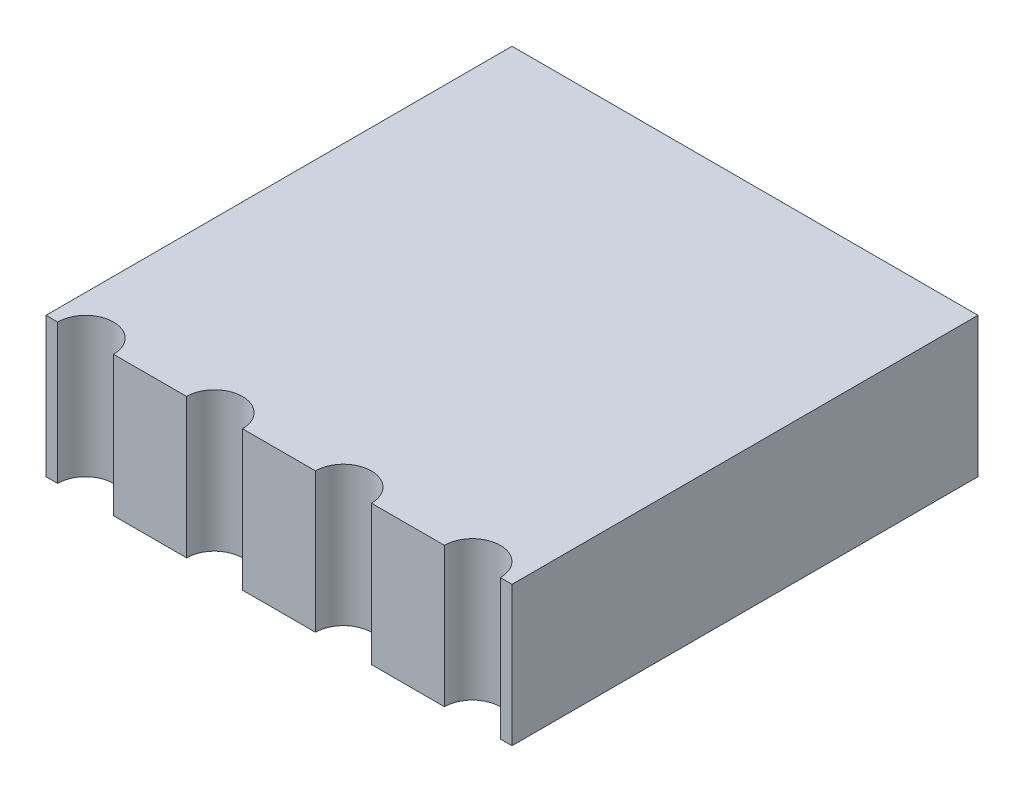
ISO-10303-21;
HEADER;
FILE_DESCRIPTION(('STEP AP214'),'2;1');
FILE_NAME('part.step','',(''),(''),'','','');
FILE_SCHEMA(('AUTOMOTIVE_DESIGN { 1 0 10303 214 1 1 1 1 }'));
ENDSEC;
DATA;
#1=APPLICATION_CONTEXT('core data for automotive mechanical design processes');
#2=APPLICATION_PROTOCOL_DEFINITION('international standard','automotive_design',2000,#1);
#3=PRODUCT_CONTEXT('',#1,'mechanical');
#4=PRODUCT('Part','Part','',(#3));
#5=PRODUCT_RELATED_PRODUCT_CATEGORY('part','',(#4));
#6=PRODUCT_DEFINITION_FORMATION('','',#4);
#7=PRODUCT_DEFINITION_CONTEXT('part definition',#1,'design');
#8=PRODUCT_DEFINITION('design','',#6,#7);
#9=PRODUCT_DEFINITION_SHAPE('','',#8);
#10=(LENGTH_UNIT() NAMED_UNIT(*) SI_UNIT(.MILLI.,.METRE.));
#11=(NAMED_UNIT(*) PLANE_ANGLE_UNIT() SI_UNIT($,.RADIAN.));
#12=(NAMED_UNIT(*) SI_UNIT($,.STERADIAN.) SOLID_ANGLE_UNIT());
#13=UNCERTAINTY_MEASURE_WITH_UNIT(LENGTH_MEASURE(1.E-05),#10,'distance_accuracy_value','');
#14=(GEOMETRIC_REPRESENTATION_CONTEXT(3) GLOBAL_UNCERTAINTY_ASSIGNED_CONTEXT((#13)) GLOBAL_UNIT_ASSIGNED_CONTEXT((#10,
#11,#12)) REPRESENTATION_CONTEXT('',''));
#15=CARTESIAN_POINT('',(0.,0.,0.));
#16=DIRECTION('',(0.,0.,1.));
#17=DIRECTION('',(1.,0.,0.));
#18=AXIS2_PLACEMENT_3D('',#15,#16,#17);
#19=CARTESIAN_POINT('',(-5.,1.5,5.));
#20=DIRECTION('',(0.,0.,-1.));
#21=DIRECTION('',(-1.,0.,0.));
#22=AXIS2_PLACEMENT_3D('',#19,#20,#21);
#23=PLANE('',#22);
#24=DIRECTION('',(1.,0.,0.));
#25=VECTOR('',#24,1.);
#26=CARTESIAN_POINT('',(-5.,-1.5,5.));
#27=LINE('',#26,#25);
#28=CARTESIAN_POINT('',(-3.55,-1.5,5.));
#29=VERTEX_POINT('',#28);
#30=CARTESIAN_POINT('',(-1.98333333333333,-1.5,5.));
#31=VERTEX_POINT('',#30);
#32=EDGE_CURVE('E151',#29,#31,#27,.T.);
#33=ORIENTED_EDGE('',*,*,#32,.T.);
#34=DIRECTION('',(0.,1.,0.));
#35=VECTOR('',#34,1.);
#36=CARTESIAN_POINT('',(-1.98333333333333,-1.5,5.));
#37=LINE('',#36,#35);
#38=CARTESIAN_POINT('',(-1.98333333333333,1.5,5.));
#39=VERTEX_POINT('',#38);
#40=EDGE_CURVE('E132',#31,#39,#37,.T.);
#41=ORIENTED_EDGE('',*,*,#40,.T.);
#42=DIRECTION('',(1.,0.,0.));
#43=VECTOR('',#42,1.);
#44=CARTESIAN_POINT('',(-5.,1.5,5.));
#45=LINE('',#44,#43);
#46=CARTESIAN_POINT('',(-3.55,1.5,5.));
#47=VERTEX_POINT('',#46);
#48=EDGE_CURVE('E206',#47,#39,#45,.T.);
#49=ORIENTED_EDGE('',*,*,#48,.F.);
#50=DIRECTION('',(0.,1.,0.));
#51=VECTOR('',#50,1.);
#52=CARTESIAN_POINT('',(-3.55,-1.5,5.));
#53=LINE('',#52,#51);
#54=EDGE_CURVE('E226',#29,#47,#53,.T.);
#55=ORIENTED_EDGE('',*,*,#54,.F.);
#56=EDGE_LOOP('',(#33,#41,#49,#55));
#57=FACE_BOUND('',#56,.T.);
#58=ADVANCED_FACE('F38',(#57),#23,.F.);
#59=CARTESIAN_POINT('',(-0.783333333333333,1.5,5.));
#60=VERTEX_POINT('',#59);
#61=CARTESIAN_POINT('',(0.783333333333334,1.5,5.));
#62=VERTEX_POINT('',#61);
#63=EDGE_CURVE('E145',#60,#62,#45,.T.);
#64=ORIENTED_EDGE('',*,*,#63,.F.);
#65=DIRECTION('',(0.,1.,0.));
#66=VECTOR('',#65,1.);
#67=CARTESIAN_POINT('',(-0.783333333333333,-1.5,5.));
#68=LINE('',#67,#66);
#69=CARTESIAN_POINT('',(-0.783333333333333,-1.5,5.));
#70=VERTEX_POINT('',#69);
#71=EDGE_CURVE('E129',#70,#60,#68,.T.);
#72=ORIENTED_EDGE('',*,*,#71,.F.);
#73=CARTESIAN_POINT('',(0.783333333333334,-1.5,5.));
#74=VERTEX_POINT('',#73);
#75=EDGE_CURVE('E143',#70,#74,#27,.T.);
#76=ORIENTED_EDGE('',*,*,#75,.T.);
#77=DIRECTION('',(0.,1.,0.));
#78=VECTOR('',#77,1.);
#79=CARTESIAN_POINT('',(0.783333333333334,-1.5,5.));
#80=LINE('',#79,#78);
#81=EDGE_CURVE('E61',#74,#62,#80,.T.);
#82=ORIENTED_EDGE('',*,*,#81,.T.);
#83=EDGE_LOOP('',(#64,#72,#76,#82));
#84=FACE_BOUND('',#83,.T.);
#85=ADVANCED_FACE('F142',(#84),#23,.F.);
#86=CARTESIAN_POINT('',(1.98333333333333,1.5,5.));
#87=VERTEX_POINT('',#86);
#88=CARTESIAN_POINT('',(3.55,1.5,5.));
#89=VERTEX_POINT('',#88);
#90=EDGE_CURVE('E199',#87,#89,#45,.T.);
#91=ORIENTED_EDGE('',*,*,#90,.F.);
#92=DIRECTION('',(0.,1.,0.));
#93=VECTOR('',#92,1.);
#94=CARTESIAN_POINT('',(1.98333333333333,-1.5,5.));
#95=LINE('',#94,#93);
#96=CARTESIAN_POINT('',(1.98333333333333,-1.5,5.));
#97=VERTEX_POINT('',#96);
#98=EDGE_CURVE('E240',#97,#87,#95,.T.);
#99=ORIENTED_EDGE('',*,*,#98,.F.);
#100=CARTESIAN_POINT('',(3.55,-1.5,5.));
#101=VERTEX_POINT('',#100);
#102=EDGE_CURVE('E152',#97,#101,#27,.T.);
#103=ORIENTED_EDGE('',*,*,#102,.T.);
#104=DIRECTION('',(0.,1.,0.));
#105=VECTOR('',#104,1.);
#106=CARTESIAN_POINT('',(3.55,-1.5,5.));
#107=LINE('',#106,#105);
#108=EDGE_CURVE('E53',#101,#89,#107,.T.);
#109=ORIENTED_EDGE('',*,*,#108,.T.);
#110=EDGE_LOOP('',(#91,#99,#103,#109));
#111=FACE_BOUND('',#110,.T.);
#112=ADVANCED_FACE('F239',(#111),#23,.F.);
#113=CARTESIAN_POINT('',(-5.,-1.5,5.));
#114=VERTEX_POINT('',#113);
#115=CARTESIAN_POINT('',(-4.75,-1.5,5.));
#116=VERTEX_POINT('',#115);
#117=EDGE_CURVE('E154',#114,#116,#27,.T.);
#118=ORIENTED_EDGE('',*,*,#117,.T.);
#119=DIRECTION('',(0.,1.,0.));
#120=VECTOR('',#119,1.);
#121=CARTESIAN_POINT('',(-4.75,-1.5,5.));
#122=LINE('',#121,#120);
#123=CARTESIAN_POINT('',(-4.75,1.5,5.));
#124=VERTEX_POINT('',#123);
#125=EDGE_CURVE('E203',#116,#124,#122,.T.);
#126=ORIENTED_EDGE('',*,*,#125,.T.);
#127=CARTESIAN_POINT('',(-5.,1.5,5.));
#128=VERTEX_POINT('',#127);
#129=EDGE_CURVE('E201',#128,#124,#45,.T.);
#130=ORIENTED_EDGE('',*,*,#129,.F.);
#131=DIRECTION('',(0.,-1.,0.));
#132=VECTOR('',#131,1.);
#133=CARTESIAN_POINT('',(-5.,1.5,5.));
#134=LINE('',#133,#132);
#135=EDGE_CURVE('E11',#128,#114,#134,.T.);
#136=ORIENTED_EDGE('',*,*,#135,.T.);
#137=EDGE_LOOP('',(#118,#126,#130,#136));
#138=FACE_BOUND('',#137,.T.);
#139=ADVANCED_FACE('F232',(#138),#23,.F.);
#140=CARTESIAN_POINT('',(-5.,1.5,5.));
#141=DIRECTION('',(1.,0.,0.));
#142=DIRECTION('',(0.,0.,-1.));
#143=AXIS2_PLACEMENT_3D('',#140,#141,#142);
#144=PLANE('',#143);
#145=DIRECTION('',(0.,0.,1.));
#146=VECTOR('',#145,1.);
#147=CARTESIAN_POINT('',(-5.,-1.5,5.));
#148=LINE('',#147,#146);
#149=CARTESIAN_POINT('',(-5.,-1.5,-5.));
#150=VERTEX_POINT('',#149);
#151=EDGE_CURVE('E161',#150,#114,#148,.T.);
#152=ORIENTED_EDGE('',*,*,#151,.T.);
#153=ORIENTED_EDGE('',*,*,#135,.F.);
#154=DIRECTION('',(0.,0.,1.));
#155=VECTOR('',#154,1.);
#156=CARTESIAN_POINT('',(-5.,1.5,5.));
#157=LINE('',#156,#155);
#158=CARTESIAN_POINT('',(-5.,1.5,-5.));
#159=VERTEX_POINT('',#158);
#160=EDGE_CURVE('E166',#159,#128,#157,.T.);
#161=ORIENTED_EDGE('',*,*,#160,.F.);
#162=DIRECTION('',(0.,-1.,0.));
#163=VECTOR('',#162,1.);
#164=CARTESIAN_POINT('',(-5.,1.5,-5.));
#165=LINE('',#164,#163);
#166=EDGE_CURVE('E167',#159,#150,#165,.T.);
#167=ORIENTED_EDGE('',*,*,#166,.T.);
#168=EDGE_LOOP('',(#152,#153,#161,#167));
#169=FACE_BOUND('',#168,.T.);
#170=ADVANCED_FACE('F40',(#169),#144,.F.);
#171=CARTESIAN_POINT('',(4.75,1.5,5.));
#172=VERTEX_POINT('',#171);
#173=CARTESIAN_POINT('',(5.,1.5,5.));
#174=VERTEX_POINT('',#173);
#175=EDGE_CURVE('E197',#172,#174,#45,.T.);
#176=ORIENTED_EDGE('',*,*,#175,.F.);
#177=DIRECTION('',(0.,1.,0.));
#178=VECTOR('',#177,1.);
#179=CARTESIAN_POINT('',(4.75,-1.5,5.));
#180=LINE('',#179,#178);
#181=CARTESIAN_POINT('',(4.75,-1.5,5.));
#182=VERTEX_POINT('',#181);
#183=EDGE_CURVE('E214',#182,#172,#180,.T.);
#184=ORIENTED_EDGE('',*,*,#183,.F.);
#185=CARTESIAN_POINT('',(5.,-1.5,5.));
#186=VERTEX_POINT('',#185);
#187=EDGE_CURVE('E156',#182,#186,#27,.T.);
#188=ORIENTED_EDGE('',*,*,#187,.T.);
#189=DIRECTION('',(0.,-1.,0.));
#190=VECTOR('',#189,1.);
#191=CARTESIAN_POINT('',(5.,1.5,5.));
#192=LINE('',#191,#190);
#193=EDGE_CURVE('E46',#174,#186,#192,.T.);
#194=ORIENTED_EDGE('',*,*,#193,.F.);
#195=EDGE_LOOP('',(#176,#184,#188,#194));
#196=FACE_BOUND('',#195,.T.);
#197=ADVANCED_FACE('F213',(#196),#23,.F.);
#198=CARTESIAN_POINT('',(5.,1.5,5.));
#199=DIRECTION('',(-1.,0.,0.));
#200=DIRECTION('',(0.,0.,1.));
#201=AXIS2_PLACEMENT_3D('',#198,#199,#200);
#202=PLANE('',#201);
#203=DIRECTION('',(0.,0.,-1.));
#204=VECTOR('',#203,1.);
#205=CARTESIAN_POINT('',(5.,-1.5,5.));
#206=LINE('',#205,#204);
#207=CARTESIAN_POINT('',(5.,-1.5,-5.));
#208=VERTEX_POINT('',#207);
#209=EDGE_CURVE('E160',#186,#208,#206,.T.);
#210=ORIENTED_EDGE('',*,*,#209,.T.);
#211=DIRECTION('',(0.,-1.,0.));
#212=VECTOR('',#211,1.);
#213=CARTESIAN_POINT('',(5.,1.5,-5.));
#214=LINE('',#213,#212);
#215=CARTESIAN_POINT('',(5.,1.5,-5.));
#216=VERTEX_POINT('',#215);
#217=EDGE_CURVE('E170',#216,#208,#214,.T.);
#218=ORIENTED_EDGE('',*,*,#217,.F.);
#219=DIRECTION('',(0.,0.,-1.));
#220=VECTOR('',#219,1.);
#221=CARTESIAN_POINT('',(5.,1.5,5.));
#222=LINE('',#221,#220);
#223=EDGE_CURVE('E180',#174,#216,#222,.T.);
#224=ORIENTED_EDGE('',*,*,#223,.F.);
#225=ORIENTED_EDGE('',*,*,#193,.T.);
#226=EDGE_LOOP('',(#210,#218,#224,#225));
#227=FACE_BOUND('',#226,.T.);
#228=ADVANCED_FACE('F178',(#227),#202,.F.);
#229=CARTESIAN_POINT('',(-5.,1.5,-5.));
#230=DIRECTION('',(0.,0.,1.));
#231=DIRECTION('',(1.,0.,0.));
#232=AXIS2_PLACEMENT_3D('',#229,#230,#231);
#233=PLANE('',#232);
#234=DIRECTION('',(-1.,0.,0.));
#235=VECTOR('',#234,1.);
#236=CARTESIAN_POINT('',(-5.,-1.5,-5.));
#237=LINE('',#236,#235);
#238=EDGE_CURVE('E164',#208,#150,#237,.T.);
#239=ORIENTED_EDGE('',*,*,#238,.T.);
#240=ORIENTED_EDGE('',*,*,#166,.F.);
#241=DIRECTION('',(-1.,0.,0.));
#242=VECTOR('',#241,1.);
#243=CARTESIAN_POINT('',(-5.,1.5,-5.));
#244=LINE('',#243,#242);
#245=EDGE_CURVE('E171',#216,#159,#244,.T.);
#246=ORIENTED_EDGE('',*,*,#245,.F.);
#247=ORIENTED_EDGE('',*,*,#217,.T.);
#248=EDGE_LOOP('',(#239,#240,#246,#247));
#249=FACE_BOUND('',#248,.T.);
#250=ADVANCED_FACE('F189',(#249),#233,.F.);
#251=CARTESIAN_POINT('',(0.,1.5,0.));
#252=DIRECTION('',(0.,-1.,0.));
#253=DIRECTION('',(0.,0.,-1.));
#254=AXIS2_PLACEMENT_3D('',#251,#252,#253);
#255=PLANE('',#254);
#256=ORIENTED_EDGE('',*,*,#48,.T.);
#257=CARTESIAN_POINT('',(-1.38333333333333,1.5,5.));
#258=DIRECTION('',(0.,1.,0.));
#259=DIRECTION('',(0.,0.,-1.));
#260=AXIS2_PLACEMENT_3D('',#257,#258,#259);
#261=CIRCLE('',#260,0.6);
#262=EDGE_CURVE('E137',#60,#39,#261,.T.);
#263=ORIENTED_EDGE('',*,*,#262,.F.);
#264=ORIENTED_EDGE('',*,*,#63,.T.);
#265=CARTESIAN_POINT('',(1.38333333333333,1.5,5.));
#266=DIRECTION('',(0.,1.,0.));
#267=DIRECTION('',(0.,0.,-1.));
#268=AXIS2_PLACEMENT_3D('',#265,#266,#267);
#269=CIRCLE('',#268,0.6);
#270=EDGE_CURVE('E215',#87,#62,#269,.T.);
#271=ORIENTED_EDGE('',*,*,#270,.F.);
#272=ORIENTED_EDGE('',*,*,#90,.T.);
#273=CARTESIAN_POINT('',(4.15,1.5,5.));
#274=DIRECTION('',(0.,1.,0.));
#275=DIRECTION('',(0.,0.,-1.));
#276=AXIS2_PLACEMENT_3D('',#273,#274,#275);
#277=CIRCLE('',#276,0.6);
#278=EDGE_CURVE('E211',#172,#89,#277,.T.);
#279=ORIENTED_EDGE('',*,*,#278,.F.);
#280=ORIENTED_EDGE('',*,*,#175,.T.);
#281=ORIENTED_EDGE('',*,*,#223,.T.);
#282=ORIENTED_EDGE('',*,*,#245,.T.);
#283=ORIENTED_EDGE('',*,*,#160,.T.);
#284=ORIENTED_EDGE('',*,*,#129,.T.);
#285=CARTESIAN_POINT('',(-4.15,1.5,5.));
#286=DIRECTION('',(0.,1.,0.));
#287=DIRECTION('',(0.,0.,-1.));
#288=AXIS2_PLACEMENT_3D('',#285,#286,#287);
#289=CIRCLE('',#288,0.6);
#290=EDGE_CURVE('E146',#47,#124,#289,.T.);
#291=ORIENTED_EDGE('',*,*,#290,.F.);
#292=EDGE_LOOP('',(#256,#263,#264,#271,#272,#279,#280,#281,#282,#283,#284,#291));
#293=FACE_BOUND('',#292,.T.);
#294=ADVANCED_FACE('F208',(#293),#255,.F.);
#295=CARTESIAN_POINT('',(0.,-1.5,0.));
#296=DIRECTION('',(0.,-1.,0.));
#297=DIRECTION('',(0.,0.,-1.));
#298=AXIS2_PLACEMENT_3D('',#295,#296,#297);
#299=PLANE('',#298);
#300=CARTESIAN_POINT('',(-1.38333333333333,-1.5,5.));
#301=DIRECTION('',(0.,1.,0.));
#302=DIRECTION('',(0.,0.,-1.));
#303=AXIS2_PLACEMENT_3D('',#300,#301,#302);
#304=CIRCLE('',#303,0.6);
#305=EDGE_CURVE('E126',#70,#31,#304,.T.);
#306=ORIENTED_EDGE('',*,*,#305,.T.);
#307=ORIENTED_EDGE('',*,*,#32,.F.);
#308=CARTESIAN_POINT('',(-4.15,-1.5,5.));
#309=DIRECTION('',(0.,1.,0.));
#310=DIRECTION('',(0.,0.,-1.));
#311=AXIS2_PLACEMENT_3D('',#308,#309,#310);
#312=CIRCLE('',#311,0.6);
#313=EDGE_CURVE('E223',#29,#116,#312,.T.);
#314=ORIENTED_EDGE('',*,*,#313,.T.);
#315=ORIENTED_EDGE('',*,*,#117,.F.);
#316=ORIENTED_EDGE('',*,*,#151,.F.);
#317=ORIENTED_EDGE('',*,*,#238,.F.);
#318=ORIENTED_EDGE('',*,*,#209,.F.);
#319=ORIENTED_EDGE('',*,*,#187,.F.);
#320=CARTESIAN_POINT('',(4.15,-1.5,5.));
#321=DIRECTION('',(0.,1.,0.));
#322=DIRECTION('',(0.,0.,-1.));
#323=AXIS2_PLACEMENT_3D('',#320,#321,#322);
#324=CIRCLE('',#323,0.6);
#325=EDGE_CURVE('E218',#182,#101,#324,.T.);
#326=ORIENTED_EDGE('',*,*,#325,.T.);
#327=ORIENTED_EDGE('',*,*,#102,.F.);
#328=CARTESIAN_POINT('',(1.38333333333333,-1.5,5.));
#329=DIRECTION('',(0.,1.,0.));
#330=DIRECTION('',(0.,0.,-1.));
#331=AXIS2_PLACEMENT_3D('',#328,#329,#330);
#332=CIRCLE('',#331,0.6);
#333=EDGE_CURVE('E150',#97,#74,#332,.T.);
#334=ORIENTED_EDGE('',*,*,#333,.T.);
#335=ORIENTED_EDGE('',*,*,#75,.F.);
#336=EDGE_LOOP('',(#306,#307,#314,#315,#316,#317,#318,#319,#326,#327,#334,#335));
#337=FACE_BOUND('',#336,.T.);
#338=ADVANCED_FACE('F148',(#337),#299,.T.);
#339=CARTESIAN_POINT('',(-4.15,-1.5,5.));
#340=DIRECTION('',(0.,1.,0.));
#341=DIRECTION('',(0.,0.,1.));
#342=AXIS2_PLACEMENT_3D('',#339,#340,#341);
#343=CYLINDRICAL_SURFACE('',#342,0.6);
#344=ORIENTED_EDGE('',*,*,#290,.T.);
#345=ORIENTED_EDGE('',*,*,#125,.F.);
#346=ORIENTED_EDGE('',*,*,#313,.F.);
#347=ORIENTED_EDGE('',*,*,#54,.T.);
#348=EDGE_LOOP('',(#344,#345,#346,#347));
#349=FACE_BOUND('',#348,.T.);
#350=ADVANCED_FACE('F255',(#349),#343,.F.);
#351=CARTESIAN_POINT('',(4.15,-1.5,5.));
#352=DIRECTION('',(0.,1.,0.));
#353=DIRECTION('',(0.,0.,1.));
#354=AXIS2_PLACEMENT_3D('',#351,#352,#353);
#355=CYLINDRICAL_SURFACE('',#354,0.6);
#356=ORIENTED_EDGE('',*,*,#278,.T.);
#357=ORIENTED_EDGE('',*,*,#108,.F.);
#358=ORIENTED_EDGE('',*,*,#325,.F.);
#359=ORIENTED_EDGE('',*,*,#183,.T.);
#360=EDGE_LOOP('',(#356,#357,#358,#359));
#361=FACE_BOUND('',#360,.T.);
#362=ADVANCED_FACE('F248',(#361),#355,.F.);
#363=CARTESIAN_POINT('',(1.38333333333333,-1.5,5.));
#364=DIRECTION('',(0.,1.,0.));
#365=DIRECTION('',(0.,0.,1.));
#366=AXIS2_PLACEMENT_3D('',#363,#364,#365);
#367=CYLINDRICAL_SURFACE('',#366,0.6);
#368=ORIENTED_EDGE('',*,*,#270,.T.);
#369=ORIENTED_EDGE('',*,*,#81,.F.);
#370=ORIENTED_EDGE('',*,*,#333,.F.);
#371=ORIENTED_EDGE('',*,*,#98,.T.);
#372=EDGE_LOOP('',(#368,#369,#370,#371));
#373=FACE_BOUND('',#372,.T.);
#374=ADVANCED_FACE('F246',(#373),#367,.F.);
#375=CARTESIAN_POINT('',(-1.38333333333333,-1.5,5.));
#376=DIRECTION('',(0.,1.,0.));
#377=DIRECTION('',(0.,0.,1.));
#378=AXIS2_PLACEMENT_3D('',#375,#376,#377);
#379=CYLINDRICAL_SURFACE('',#378,0.6);
#380=ORIENTED_EDGE('',*,*,#262,.T.);
#381=ORIENTED_EDGE('',*,*,#40,.F.);
#382=ORIENTED_EDGE('',*,*,#305,.F.);
#383=ORIENTED_EDGE('',*,*,#71,.T.);
#384=EDGE_LOOP('',(#380,#381,#382,#383));
#385=FACE_BOUND('',#384,.T.);
#386=ADVANCED_FACE('F128',(#385),#379,.F.);
#387=CLOSED_SHELL('',(#58,#85,#112,#139,#170,#197,#228,#250,#294,#338,#350,#362,#374,#386));
#388=MANIFOLD_SOLID_BREP('B2',#387);
#389=ADVANCED_BREP_SHAPE_REPRESENTATION('',(#18,#388),#14);
#390=SHAPE_DEFINITION_REPRESENTATION(#9,#389);
ENDSEC;
END-ISO-10303-21;
